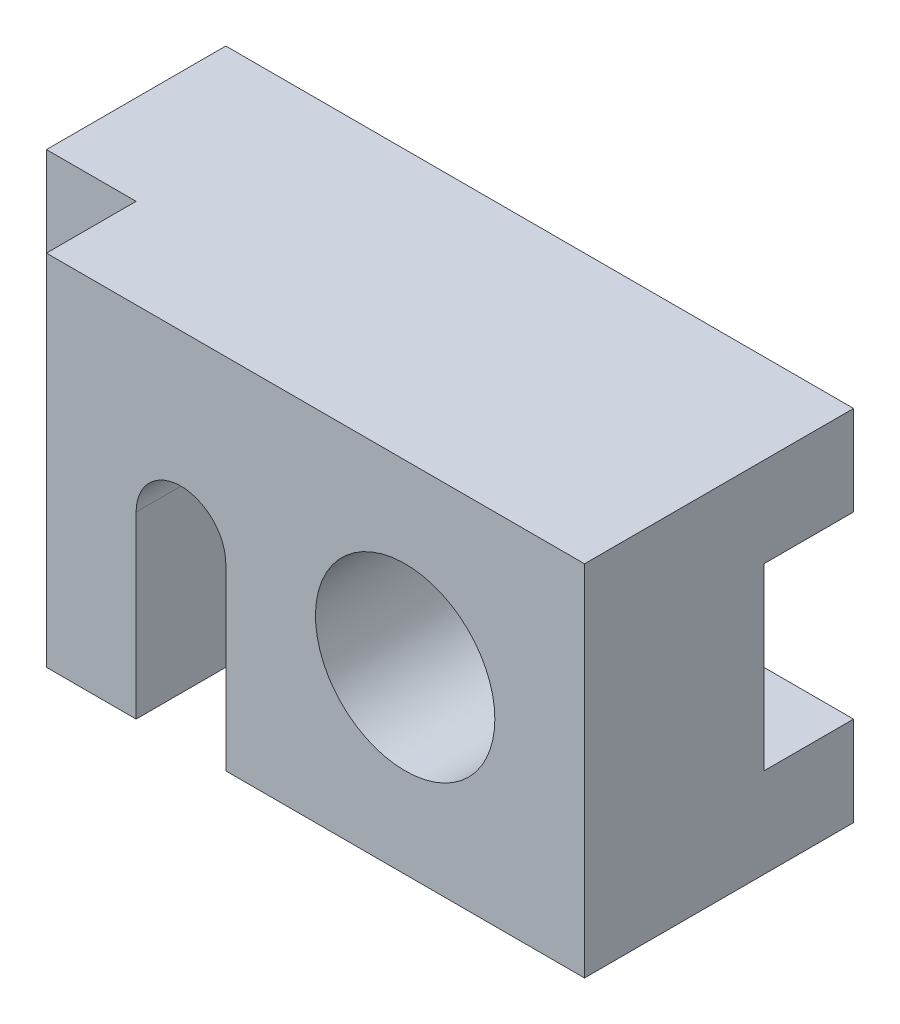
ISO-10303-21;
HEADER;
FILE_DESCRIPTION(('STEP AP214'),'2;1');
FILE_NAME('part.step','',(''),(''),'','','');
FILE_SCHEMA(('AUTOMOTIVE_DESIGN { 1 0 10303 214 1 1 1 1 }'));
ENDSEC;
DATA;
#1=APPLICATION_CONTEXT('core data for automotive mechanical design processes');
#2=APPLICATION_PROTOCOL_DEFINITION('international standard','automotive_design',2000,#1);
#3=PRODUCT_CONTEXT('',#1,'mechanical');
#4=PRODUCT('Part','Part','',(#3));
#5=PRODUCT_RELATED_PRODUCT_CATEGORY('part','',(#4));
#6=PRODUCT_DEFINITION_FORMATION('','',#4);
#7=PRODUCT_DEFINITION_CONTEXT('part definition',#1,'design');
#8=PRODUCT_DEFINITION('design','',#6,#7);
#9=PRODUCT_DEFINITION_SHAPE('','',#8);
#10=(LENGTH_UNIT() NAMED_UNIT(*) SI_UNIT(.MILLI.,.METRE.));
#11=(NAMED_UNIT(*) PLANE_ANGLE_UNIT() SI_UNIT($,.RADIAN.));
#12=(NAMED_UNIT(*) SI_UNIT($,.STERADIAN.) SOLID_ANGLE_UNIT());
#13=UNCERTAINTY_MEASURE_WITH_UNIT(LENGTH_MEASURE(1.E-05),#10,'distance_accuracy_value','');
#14=(GEOMETRIC_REPRESENTATION_CONTEXT(3) GLOBAL_UNCERTAINTY_ASSIGNED_CONTEXT((#13)) GLOBAL_UNIT_ASSIGNED_CONTEXT((#10,
#11,#12)) REPRESENTATION_CONTEXT('',''));
#15=CARTESIAN_POINT('',(0.,0.,0.));
#16=DIRECTION('',(0.,0.,1.));
#17=DIRECTION('',(1.,0.,0.));
#18=AXIS2_PLACEMENT_3D('',#15,#16,#17);
#19=CARTESIAN_POINT('',(0.,12.,36.));
#20=DIRECTION('',(0.,1.,0.));
#21=DIRECTION('',(0.,0.,1.));
#22=AXIS2_PLACEMENT_3D('',#19,#20,#21);
#23=PLANE('',#22);
#24=DIRECTION('',(-1.,0.,0.));
#25=VECTOR('',#24,1.);
#26=CARTESIAN_POINT('',(84.,12.,12.));
#27=LINE('',#26,#25);
#28=CARTESIAN_POINT('',(24.,12.,12.));
#29=VERTEX_POINT('',#28);
#30=CARTESIAN_POINT('',(0.,12.,12.));
#31=VERTEX_POINT('',#30);
#32=EDGE_CURVE('E189',#29,#31,#27,.T.);
#33=ORIENTED_EDGE('',*,*,#32,.F.);
#34=DIRECTION('',(-1.,0.,0.));
#35=VECTOR('',#34,1.);
#36=CARTESIAN_POINT('',(24.,12.,12.));
#37=LINE('',#36,#35);
#38=CARTESIAN_POINT('',(36.,12.,12.));
#39=VERTEX_POINT('',#38);
#40=EDGE_CURVE('E160',#39,#29,#37,.T.);
#41=ORIENTED_EDGE('',*,*,#40,.F.);
#42=CARTESIAN_POINT('',(60.,12.,12.));
#43=VERTEX_POINT('',#42);
#44=EDGE_CURVE('E202',#43,#39,#27,.T.);
#45=ORIENTED_EDGE('',*,*,#44,.F.);
#46=CARTESIAN_POINT('',(84.,12.,12.));
#47=VERTEX_POINT('',#46);
#48=EDGE_CURVE('E199',#47,#43,#27,.T.);
#49=ORIENTED_EDGE('',*,*,#48,.F.);
#50=DIRECTION('',(0.,0.,1.));
#51=VECTOR('',#50,1.);
#52=CARTESIAN_POINT('',(84.,12.,0.));
#53=LINE('',#52,#51);
#54=CARTESIAN_POINT('',(84.,12.,0.));
#55=VERTEX_POINT('',#54);
#56=EDGE_CURVE('E179',#55,#47,#53,.T.);
#57=ORIENTED_EDGE('',*,*,#56,.F.);
#58=DIRECTION('',(1.,0.,0.));
#59=VECTOR('',#58,1.);
#60=CARTESIAN_POINT('',(0.,12.,0.));
#61=LINE('',#60,#59);
#62=CARTESIAN_POINT('',(0.,12.,0.));
#63=VERTEX_POINT('',#62);
#64=EDGE_CURVE('E257',#63,#55,#61,.T.);
#65=ORIENTED_EDGE('',*,*,#64,.F.);
#66=DIRECTION('',(0.,0.,1.));
#67=VECTOR('',#66,1.);
#68=CARTESIAN_POINT('',(0.,12.,0.));
#69=LINE('',#68,#67);
#70=EDGE_CURVE('E177',#63,#31,#69,.T.);
#71=ORIENTED_EDGE('',*,*,#70,.T.);
#72=EDGE_LOOP('',(#33,#41,#45,#49,#57,#65,#71));
#73=FACE_BOUND('',#72,.T.);
#74=ADVANCED_FACE('F35',(#73),#23,.T.);
#75=CARTESIAN_POINT('',(0.,0.,0.));
#76=DIRECTION('',(0.,0.,1.));
#77=DIRECTION('',(1.,0.,0.));
#78=AXIS2_PLACEMENT_3D('',#75,#76,#77);
#79=PLANE('',#78);
#80=DIRECTION('',(0.,1.,0.));
#81=VECTOR('',#80,1.);
#82=CARTESIAN_POINT('',(84.,0.,0.));
#83=LINE('',#82,#81);
#84=CARTESIAN_POINT('',(84.,36.,0.));
#85=VERTEX_POINT('',#84);
#86=CARTESIAN_POINT('',(84.,48.,0.));
#87=VERTEX_POINT('',#86);
#88=EDGE_CURVE('E250',#85,#87,#83,.T.);
#89=ORIENTED_EDGE('',*,*,#88,.F.);
#90=DIRECTION('',(-1.,0.,0.));
#91=VECTOR('',#90,1.);
#92=CARTESIAN_POINT('',(0.,36.,0.));
#93=LINE('',#92,#91);
#94=CARTESIAN_POINT('',(0.,36.,0.));
#95=VERTEX_POINT('',#94);
#96=EDGE_CURVE('E43',#85,#95,#93,.T.);
#97=ORIENTED_EDGE('',*,*,#96,.T.);
#98=DIRECTION('',(0.,1.,0.));
#99=VECTOR('',#98,1.);
#100=CARTESIAN_POINT('',(0.,0.,0.));
#101=LINE('',#100,#99);
#102=CARTESIAN_POINT('',(0.,48.,0.));
#103=VERTEX_POINT('',#102);
#104=EDGE_CURVE('E225',#95,#103,#101,.T.);
#105=ORIENTED_EDGE('',*,*,#104,.T.);
#106=DIRECTION('',(1.,0.,0.));
#107=VECTOR('',#106,1.);
#108=CARTESIAN_POINT('',(0.,48.,0.));
#109=LINE('',#108,#107);
#110=EDGE_CURVE('E254',#103,#87,#109,.T.);
#111=ORIENTED_EDGE('',*,*,#110,.T.);
#112=EDGE_LOOP('',(#89,#97,#105,#111));
#113=FACE_BOUND('',#112,.T.);
#114=ADVANCED_FACE('F278',(#113),#79,.F.);
#115=CARTESIAN_POINT('',(24.,0.,36.));
#116=DIRECTION('',(1.,0.,0.));
#117=DIRECTION('',(0.,0.,-1.));
#118=AXIS2_PLACEMENT_3D('',#115,#116,#117);
#119=PLANE('',#118);
#120=DIRECTION('',(0.,-1.,0.));
#121=VECTOR('',#120,1.);
#122=CARTESIAN_POINT('',(24.,0.,12.));
#123=LINE('',#122,#121);
#124=CARTESIAN_POINT('',(24.,24.,12.));
#125=VERTEX_POINT('',#124);
#126=EDGE_CURVE('E205',#125,#29,#123,.T.);
#127=ORIENTED_EDGE('',*,*,#126,.F.);
#128=DIRECTION('',(0.,0.,-1.));
#129=VECTOR('',#128,1.);
#130=CARTESIAN_POINT('',(24.,24.,36.));
#131=LINE('',#130,#129);
#132=CARTESIAN_POINT('',(24.,24.,36.));
#133=VERTEX_POINT('',#132);
#134=EDGE_CURVE('E262',#133,#125,#131,.T.);
#135=ORIENTED_EDGE('',*,*,#134,.F.);
#136=DIRECTION('',(0.,-1.,0.));
#137=VECTOR('',#136,1.);
#138=CARTESIAN_POINT('',(24.,0.,36.));
#139=LINE('',#138,#137);
#140=CARTESIAN_POINT('',(24.,0.,36.));
#141=VERTEX_POINT('',#140);
#142=EDGE_CURVE('E154',#133,#141,#139,.T.);
#143=ORIENTED_EDGE('',*,*,#142,.T.);
#144=DIRECTION('',(0.,0.,1.));
#145=VECTOR('',#144,1.);
#146=CARTESIAN_POINT('',(24.,0.,12.));
#147=LINE('',#146,#145);
#148=CARTESIAN_POINT('',(24.,0.,12.));
#149=VERTEX_POINT('',#148);
#150=EDGE_CURVE('E147',#149,#141,#147,.T.);
#151=ORIENTED_EDGE('',*,*,#150,.F.);
#152=DIRECTION('',(0.,-1.,0.));
#153=VECTOR('',#152,1.);
#154=CARTESIAN_POINT('',(24.,12.,12.));
#155=LINE('',#154,#153);
#156=EDGE_CURVE('E151',#29,#149,#155,.T.);
#157=ORIENTED_EDGE('',*,*,#156,.F.);
#158=EDGE_LOOP('',(#127,#135,#143,#151,#157));
#159=FACE_BOUND('',#158,.T.);
#160=ADVANCED_FACE('F150',(#159),#119,.T.);
#161=CARTESIAN_POINT('',(30.,24.0000002016372,36.));
#162=DIRECTION('',(0.,0.,-1.));
#163=DIRECTION('',(-1.,0.,0.));
#164=AXIS2_PLACEMENT_3D('',#161,#162,#163);
#165=CYLINDRICAL_SURFACE('',#164,6.);
#166=ORIENTED_EDGE('',*,*,#134,.T.);
#167=CARTESIAN_POINT('',(30.,24.0000002016372,12.));
#168=DIRECTION('',(0.,0.,1.));
#169=DIRECTION('',(0.,-1.,0.));
#170=AXIS2_PLACEMENT_3D('',#167,#168,#169);
#171=CIRCLE('',#170,6.);
#172=CARTESIAN_POINT('',(36.,24.,12.));
#173=VERTEX_POINT('',#172);
#174=EDGE_CURVE('E197',#125,#173,#171,.F.);
#175=ORIENTED_EDGE('',*,*,#174,.T.);
#176=DIRECTION('',(0.,0.,-1.));
#177=VECTOR('',#176,1.);
#178=CARTESIAN_POINT('',(36.,24.,36.));
#179=LINE('',#178,#177);
#180=CARTESIAN_POINT('',(36.,24.,36.));
#181=VERTEX_POINT('',#180);
#182=EDGE_CURVE('E259',#181,#173,#179,.T.);
#183=ORIENTED_EDGE('',*,*,#182,.F.);
#184=CARTESIAN_POINT('',(30.,24.0000002016372,36.));
#185=DIRECTION('',(0.,0.,1.));
#186=DIRECTION('',(1.,0.,0.));
#187=AXIS2_PLACEMENT_3D('',#184,#185,#186);
#188=CIRCLE('',#187,6.);
#189=EDGE_CURVE('E241',#133,#181,#188,.F.);
#190=ORIENTED_EDGE('',*,*,#189,.F.);
#191=EDGE_LOOP('',(#166,#175,#183,#190));
#192=FACE_BOUND('',#191,.T.);
#193=ADVANCED_FACE('F333',(#192),#165,.F.);
#194=CARTESIAN_POINT('',(0.,0.,36.));
#195=DIRECTION('',(-1.,0.,0.));
#196=DIRECTION('',(0.,0.,1.));
#197=AXIS2_PLACEMENT_3D('',#194,#195,#196);
#198=PLANE('',#197);
#199=DIRECTION('',(0.,0.,-1.));
#200=VECTOR('',#199,1.);
#201=CARTESIAN_POINT('',(0.,36.,0.));
#202=LINE('',#201,#200);
#203=CARTESIAN_POINT('',(0.,36.,12.));
#204=VERTEX_POINT('',#203);
#205=EDGE_CURVE('E183',#204,#95,#202,.T.);
#206=ORIENTED_EDGE('',*,*,#205,.F.);
#207=DIRECTION('',(0.,1.,0.));
#208=VECTOR('',#207,1.);
#209=CARTESIAN_POINT('',(0.,36.,12.));
#210=LINE('',#209,#208);
#211=EDGE_CURVE('E192',#31,#204,#210,.T.);
#212=ORIENTED_EDGE('',*,*,#211,.F.);
#213=ORIENTED_EDGE('',*,*,#70,.F.);
#214=CARTESIAN_POINT('',(0.,0.,0.));
#215=VERTEX_POINT('',#214);
#216=EDGE_CURVE('E245',#215,#63,#101,.T.);
#217=ORIENTED_EDGE('',*,*,#216,.F.);
#218=DIRECTION('',(0.,0.,-1.));
#219=VECTOR('',#218,1.);
#220=CARTESIAN_POINT('',(0.,0.,36.));
#221=LINE('',#220,#219);
#222=CARTESIAN_POINT('',(0.,0.,24.));
#223=VERTEX_POINT('',#222);
#224=EDGE_CURVE('E263',#223,#215,#221,.T.);
#225=ORIENTED_EDGE('',*,*,#224,.F.);
#226=DIRECTION('',(0.,1.,0.));
#227=VECTOR('',#226,1.);
#228=CARTESIAN_POINT('',(0.,0.,24.));
#229=LINE('',#228,#227);
#230=CARTESIAN_POINT('',(0.,48.,24.));
#231=VERTEX_POINT('',#230);
#232=EDGE_CURVE('E222',#223,#231,#229,.T.);
#233=ORIENTED_EDGE('',*,*,#232,.T.);
#234=DIRECTION('',(0.,0.,-1.));
#235=VECTOR('',#234,1.);
#236=CARTESIAN_POINT('',(0.,48.,36.));
#237=LINE('',#236,#235);
#238=EDGE_CURVE('E244',#231,#103,#237,.T.);
#239=ORIENTED_EDGE('',*,*,#238,.T.);
#240=ORIENTED_EDGE('',*,*,#104,.F.);
#241=EDGE_LOOP('',(#206,#212,#213,#217,#225,#233,#239,#240));
#242=FACE_BOUND('',#241,.T.);
#243=ADVANCED_FACE('F37',(#242),#198,.T.);
#244=CARTESIAN_POINT('',(0.,0.,36.));
#245=DIRECTION('',(0.,1.,0.));
#246=DIRECTION('',(0.,0.,1.));
#247=AXIS2_PLACEMENT_3D('',#244,#245,#246);
#248=PLANE('',#247);
#249=DIRECTION('',(1.,0.,0.));
#250=VECTOR('',#249,1.);
#251=CARTESIAN_POINT('',(24.,0.,12.));
#252=LINE('',#251,#250);
#253=CARTESIAN_POINT('',(36.,0.,12.));
#254=VERTEX_POINT('',#253);
#255=EDGE_CURVE('E165',#149,#254,#252,.T.);
#256=ORIENTED_EDGE('',*,*,#255,.F.);
#257=ORIENTED_EDGE('',*,*,#150,.T.);
#258=DIRECTION('',(1.,0.,0.));
#259=VECTOR('',#258,1.);
#260=CARTESIAN_POINT('',(0.,0.,36.));
#261=LINE('',#260,#259);
#262=CARTESIAN_POINT('',(12.,0.,36.));
#263=VERTEX_POINT('',#262);
#264=EDGE_CURVE('E229',#263,#141,#261,.T.);
#265=ORIENTED_EDGE('',*,*,#264,.F.);
#266=DIRECTION('',(0.,0.,-1.));
#267=VECTOR('',#266,1.);
#268=CARTESIAN_POINT('',(12.,0.,36.));
#269=LINE('',#268,#267);
#270=CARTESIAN_POINT('',(12.,0.,24.));
#271=VERTEX_POINT('',#270);
#272=EDGE_CURVE('E210',#263,#271,#269,.T.);
#273=ORIENTED_EDGE('',*,*,#272,.T.);
#274=DIRECTION('',(-1.,0.,0.));
#275=VECTOR('',#274,1.);
#276=CARTESIAN_POINT('',(0.,0.,24.));
#277=LINE('',#276,#275);
#278=EDGE_CURVE('E213',#271,#223,#277,.T.);
#279=ORIENTED_EDGE('',*,*,#278,.T.);
#280=ORIENTED_EDGE('',*,*,#224,.T.);
#281=DIRECTION('',(1.,0.,0.));
#282=VECTOR('',#281,1.);
#283=CARTESIAN_POINT('',(0.,0.,0.));
#284=LINE('',#283,#282);
#285=CARTESIAN_POINT('',(84.,0.,0.));
#286=VERTEX_POINT('',#285);
#287=EDGE_CURVE('E248',#215,#286,#284,.T.);
#288=ORIENTED_EDGE('',*,*,#287,.T.);
#289=DIRECTION('',(0.,0.,-1.));
#290=VECTOR('',#289,1.);
#291=CARTESIAN_POINT('',(84.,0.,36.));
#292=LINE('',#291,#290);
#293=CARTESIAN_POINT('',(84.,0.,36.));
#294=VERTEX_POINT('',#293);
#295=EDGE_CURVE('E271',#294,#286,#292,.T.);
#296=ORIENTED_EDGE('',*,*,#295,.F.);
#297=CARTESIAN_POINT('',(36.,0.,36.));
#298=VERTEX_POINT('',#297);
#299=EDGE_CURVE('E232',#298,#294,#261,.T.);
#300=ORIENTED_EDGE('',*,*,#299,.F.);
#301=DIRECTION('',(0.,0.,1.));
#302=VECTOR('',#301,1.);
#303=CARTESIAN_POINT('',(36.,0.,12.));
#304=LINE('',#303,#302);
#305=EDGE_CURVE('E159',#254,#298,#304,.T.);
#306=ORIENTED_EDGE('',*,*,#305,.F.);
#307=EDGE_LOOP('',(#256,#257,#265,#273,#279,#280,#288,#296,#300,#306));
#308=FACE_BOUND('',#307,.T.);
#309=ADVANCED_FACE('F170',(#308),#248,.F.);
#310=CARTESIAN_POINT('',(84.,0.,36.));
#311=DIRECTION('',(-1.,0.,0.));
#312=DIRECTION('',(0.,-1.,0.));
#313=AXIS2_PLACEMENT_3D('',#310,#311,#312);
#314=PLANE('',#313);
#315=DIRECTION('',(0.,1.,0.));
#316=VECTOR('',#315,1.);
#317=CARTESIAN_POINT('',(84.,36.,12.));
#318=LINE('',#317,#316);
#319=CARTESIAN_POINT('',(84.,36.,12.));
#320=VERTEX_POINT('',#319);
#321=EDGE_CURVE('E182',#47,#320,#318,.T.);
#322=ORIENTED_EDGE('',*,*,#321,.T.);
#323=DIRECTION('',(0.,0.,-1.));
#324=VECTOR('',#323,1.);
#325=CARTESIAN_POINT('',(84.,36.,0.));
#326=LINE('',#325,#324);
#327=EDGE_CURVE('E186',#320,#85,#326,.T.);
#328=ORIENTED_EDGE('',*,*,#327,.T.);
#329=ORIENTED_EDGE('',*,*,#88,.T.);
#330=DIRECTION('',(0.,0.,-1.));
#331=VECTOR('',#330,1.);
#332=CARTESIAN_POINT('',(84.,48.,36.));
#333=LINE('',#332,#331);
#334=CARTESIAN_POINT('',(84.,48.,36.));
#335=VERTEX_POINT('',#334);
#336=EDGE_CURVE('E268',#335,#87,#333,.T.);
#337=ORIENTED_EDGE('',*,*,#336,.F.);
#338=DIRECTION('',(0.,1.,0.));
#339=VECTOR('',#338,1.);
#340=CARTESIAN_POINT('',(84.,0.,36.));
#341=LINE('',#340,#339);
#342=EDGE_CURVE('E231',#294,#335,#341,.T.);
#343=ORIENTED_EDGE('',*,*,#342,.F.);
#344=ORIENTED_EDGE('',*,*,#295,.T.);
#345=EDGE_CURVE('E251',#286,#55,#83,.T.);
#346=ORIENTED_EDGE('',*,*,#345,.T.);
#347=ORIENTED_EDGE('',*,*,#56,.T.);
#348=EDGE_LOOP('',(#322,#328,#329,#337,#343,#344,#346,#347));
#349=FACE_BOUND('',#348,.T.);
#350=ADVANCED_FACE('F293',(#349),#314,.F.);
#351=CARTESIAN_POINT('',(60.,24.,36.));
#352=DIRECTION('',(0.,0.,-1.));
#353=DIRECTION('',(-1.,0.,0.));
#354=AXIS2_PLACEMENT_3D('',#351,#352,#353);
#355=CYLINDRICAL_SURFACE('',#354,12.);
#356=CARTESIAN_POINT('',(60.,24.,12.));
#357=DIRECTION('',(0.,0.,1.));
#358=DIRECTION('',(0.,-1.,0.));
#359=AXIS2_PLACEMENT_3D('',#356,#357,#358);
#360=CIRCLE('',#359,12.);
#361=CARTESIAN_POINT('',(60.,36.,12.));
#362=VERTEX_POINT('',#361);
#363=EDGE_CURVE('E209',#43,#362,#360,.T.);
#364=ORIENTED_EDGE('',*,*,#363,.F.);
#365=EDGE_CURVE('E207',#362,#43,#360,.T.);
#366=ORIENTED_EDGE('',*,*,#365,.F.);
#367=EDGE_LOOP('',(#364,#366));
#368=FACE_BOUND('',#367,.T.);
#369=CARTESIAN_POINT('',(60.,24.,36.));
#370=DIRECTION('',(0.,0.,1.));
#371=DIRECTION('',(1.,0.,0.));
#372=AXIS2_PLACEMENT_3D('',#369,#370,#371);
#373=CIRCLE('',#372,12.);
#374=CARTESIAN_POINT('',(72.,24.,36.));
#375=VERTEX_POINT('',#374);
#376=EDGE_CURVE('E237',#375,#375,#373,.T.);
#377=ORIENTED_EDGE('',*,*,#376,.T.);
#378=EDGE_LOOP('',(#377));
#379=FACE_BOUND('',#378,.T.);
#380=ADVANCED_FACE('F321',(#368,#379),#355,.F.);
#381=CARTESIAN_POINT('',(0.,48.,36.));
#382=DIRECTION('',(0.,1.,0.));
#383=DIRECTION('',(0.,0.,1.));
#384=AXIS2_PLACEMENT_3D('',#381,#382,#383);
#385=PLANE('',#384);
#386=DIRECTION('',(-1.,0.,0.));
#387=VECTOR('',#386,1.);
#388=CARTESIAN_POINT('',(0.,48.,24.));
#389=LINE('',#388,#387);
#390=CARTESIAN_POINT('',(12.,48.,24.));
#391=VERTEX_POINT('',#390);
#392=EDGE_CURVE('E214',#391,#231,#389,.T.);
#393=ORIENTED_EDGE('',*,*,#392,.F.);
#394=DIRECTION('',(0.,0.,-1.));
#395=VECTOR('',#394,1.);
#396=CARTESIAN_POINT('',(12.,48.,36.));
#397=LINE('',#396,#395);
#398=CARTESIAN_POINT('',(12.,48.,36.));
#399=VERTEX_POINT('',#398);
#400=EDGE_CURVE('E218',#399,#391,#397,.T.);
#401=ORIENTED_EDGE('',*,*,#400,.F.);
#402=DIRECTION('',(1.,0.,0.));
#403=VECTOR('',#402,1.);
#404=CARTESIAN_POINT('',(0.,48.,36.));
#405=LINE('',#404,#403);
#406=EDGE_CURVE('E235',#399,#335,#405,.T.);
#407=ORIENTED_EDGE('',*,*,#406,.T.);
#408=ORIENTED_EDGE('',*,*,#336,.T.);
#409=ORIENTED_EDGE('',*,*,#110,.F.);
#410=ORIENTED_EDGE('',*,*,#238,.F.);
#411=EDGE_LOOP('',(#393,#401,#407,#408,#409,#410));
#412=FACE_BOUND('',#411,.T.);
#413=ADVANCED_FACE('F287',(#412),#385,.T.);
#414=CARTESIAN_POINT('',(36.,0.,36.));
#415=DIRECTION('',(1.,0.,0.));
#416=DIRECTION('',(0.,0.,-1.));
#417=AXIS2_PLACEMENT_3D('',#414,#415,#416);
#418=PLANE('',#417);
#419=ORIENTED_EDGE('',*,*,#182,.T.);
#420=DIRECTION('',(0.,-1.,0.));
#421=VECTOR('',#420,1.);
#422=CARTESIAN_POINT('',(36.,0.,12.));
#423=LINE('',#422,#421);
#424=EDGE_CURVE('E11',#173,#39,#423,.T.);
#425=ORIENTED_EDGE('',*,*,#424,.T.);
#426=DIRECTION('',(0.,1.,0.));
#427=VECTOR('',#426,1.);
#428=CARTESIAN_POINT('',(36.,12.,12.));
#429=LINE('',#428,#427);
#430=EDGE_CURVE('E172',#254,#39,#429,.T.);
#431=ORIENTED_EDGE('',*,*,#430,.F.);
#432=ORIENTED_EDGE('',*,*,#305,.T.);
#433=DIRECTION('',(0.,-1.,0.));
#434=VECTOR('',#433,1.);
#435=CARTESIAN_POINT('',(36.,0.,36.));
#436=LINE('',#435,#434);
#437=EDGE_CURVE('E50',#181,#298,#436,.T.);
#438=ORIENTED_EDGE('',*,*,#437,.F.);
#439=EDGE_LOOP('',(#419,#425,#431,#432,#438));
#440=FACE_BOUND('',#439,.T.);
#441=ADVANCED_FACE('F327',(#440),#418,.F.);
#442=CARTESIAN_POINT('',(0.,0.,36.));
#443=DIRECTION('',(0.,0.,1.));
#444=DIRECTION('',(1.,0.,0.));
#445=AXIS2_PLACEMENT_3D('',#442,#443,#444);
#446=PLANE('',#445);
#447=ORIENTED_EDGE('',*,*,#264,.T.);
#448=ORIENTED_EDGE('',*,*,#142,.F.);
#449=ORIENTED_EDGE('',*,*,#189,.T.);
#450=ORIENTED_EDGE('',*,*,#437,.T.);
#451=ORIENTED_EDGE('',*,*,#299,.T.);
#452=ORIENTED_EDGE('',*,*,#342,.T.);
#453=ORIENTED_EDGE('',*,*,#406,.F.);
#454=DIRECTION('',(0.,1.,0.));
#455=VECTOR('',#454,1.);
#456=CARTESIAN_POINT('',(12.,0.,36.));
#457=LINE('',#456,#455);
#458=EDGE_CURVE('E217',#263,#399,#457,.T.);
#459=ORIENTED_EDGE('',*,*,#458,.F.);
#460=EDGE_LOOP('',(#447,#448,#449,#450,#451,#452,#453,#459));
#461=FACE_BOUND('',#460,.T.);
#462=ORIENTED_EDGE('',*,*,#376,.F.);
#463=EDGE_LOOP('',(#462));
#464=FACE_BOUND('',#463,.T.);
#465=ADVANCED_FACE('F343',(#461,#464),#446,.T.);
#466=ORIENTED_EDGE('',*,*,#216,.T.);
#467=ORIENTED_EDGE('',*,*,#64,.T.);
#468=ORIENTED_EDGE('',*,*,#345,.F.);
#469=ORIENTED_EDGE('',*,*,#287,.F.);
#470=EDGE_LOOP('',(#466,#467,#468,#469));
#471=FACE_BOUND('',#470,.T.);
#472=ADVANCED_FACE('F316',(#471),#79,.F.);
#473=CARTESIAN_POINT('',(0.,0.,24.));
#474=DIRECTION('',(0.,0.,-1.));
#475=DIRECTION('',(-1.,0.,0.));
#476=AXIS2_PLACEMENT_3D('',#473,#474,#475);
#477=PLANE('',#476);
#478=ORIENTED_EDGE('',*,*,#392,.T.);
#479=ORIENTED_EDGE('',*,*,#232,.F.);
#480=ORIENTED_EDGE('',*,*,#278,.F.);
#481=DIRECTION('',(0.,1.,0.));
#482=VECTOR('',#481,1.);
#483=CARTESIAN_POINT('',(12.,0.,24.));
#484=LINE('',#483,#482);
#485=EDGE_CURVE('E226',#271,#391,#484,.T.);
#486=ORIENTED_EDGE('',*,*,#485,.T.);
#487=EDGE_LOOP('',(#478,#479,#480,#486));
#488=FACE_BOUND('',#487,.T.);
#489=ADVANCED_FACE('F347',(#488),#477,.F.);
#490=CARTESIAN_POINT('',(12.,0.,36.));
#491=DIRECTION('',(1.,0.,0.));
#492=DIRECTION('',(0.,0.,-1.));
#493=AXIS2_PLACEMENT_3D('',#490,#491,#492);
#494=PLANE('',#493);
#495=ORIENTED_EDGE('',*,*,#400,.T.);
#496=ORIENTED_EDGE('',*,*,#485,.F.);
#497=ORIENTED_EDGE('',*,*,#272,.F.);
#498=ORIENTED_EDGE('',*,*,#458,.T.);
#499=EDGE_LOOP('',(#495,#496,#497,#498));
#500=FACE_BOUND('',#499,.T.);
#501=ADVANCED_FACE('F306',(#500),#494,.F.);
#502=CARTESIAN_POINT('',(84.,36.,12.));
#503=DIRECTION('',(0.,0.,1.));
#504=DIRECTION('',(0.,-1.,0.));
#505=AXIS2_PLACEMENT_3D('',#502,#503,#504);
#506=PLANE('',#505);
#507=ORIENTED_EDGE('',*,*,#363,.T.);
#508=DIRECTION('',(-1.,0.,0.));
#509=VECTOR('',#508,1.);
#510=CARTESIAN_POINT('',(84.,36.,12.));
#511=LINE('',#510,#509);
#512=EDGE_CURVE('E58',#320,#362,#511,.T.);
#513=ORIENTED_EDGE('',*,*,#512,.F.);
#514=ORIENTED_EDGE('',*,*,#321,.F.);
#515=ORIENTED_EDGE('',*,*,#48,.T.);
#516=EDGE_LOOP('',(#507,#513,#514,#515));
#517=FACE_BOUND('',#516,.T.);
#518=ADVANCED_FACE('F298',(#517),#506,.F.);
#519=CARTESIAN_POINT('',(84.,36.,0.));
#520=DIRECTION('',(0.,1.,0.));
#521=DIRECTION('',(0.,0.,1.));
#522=AXIS2_PLACEMENT_3D('',#519,#520,#521);
#523=PLANE('',#522);
#524=EDGE_CURVE('E198',#362,#204,#511,.T.);
#525=ORIENTED_EDGE('',*,*,#524,.T.);
#526=ORIENTED_EDGE('',*,*,#205,.T.);
#527=ORIENTED_EDGE('',*,*,#96,.F.);
#528=ORIENTED_EDGE('',*,*,#327,.F.);
#529=ORIENTED_EDGE('',*,*,#512,.T.);
#530=EDGE_LOOP('',(#525,#526,#527,#528,#529));
#531=FACE_BOUND('',#530,.T.);
#532=ADVANCED_FACE('F295',(#531),#523,.F.);
#533=ORIENTED_EDGE('',*,*,#365,.T.);
#534=ORIENTED_EDGE('',*,*,#44,.T.);
#535=ORIENTED_EDGE('',*,*,#424,.F.);
#536=ORIENTED_EDGE('',*,*,#174,.F.);
#537=ORIENTED_EDGE('',*,*,#126,.T.);
#538=ORIENTED_EDGE('',*,*,#32,.T.);
#539=ORIENTED_EDGE('',*,*,#211,.T.);
#540=ORIENTED_EDGE('',*,*,#524,.F.);
#541=EDGE_LOOP('',(#533,#534,#535,#536,#537,#538,#539,#540));
#542=FACE_BOUND('',#541,.T.);
#543=ADVANCED_FACE('F297',(#542),#506,.F.);
#544=CARTESIAN_POINT('',(0.,0.,12.));
#545=DIRECTION('',(0.,0.,1.));
#546=DIRECTION('',(1.,0.,0.));
#547=AXIS2_PLACEMENT_3D('',#544,#545,#546);
#548=PLANE('',#547);
#549=ORIENTED_EDGE('',*,*,#156,.T.);
#550=ORIENTED_EDGE('',*,*,#255,.T.);
#551=ORIENTED_EDGE('',*,*,#430,.T.);
#552=ORIENTED_EDGE('',*,*,#40,.T.);
#553=EDGE_LOOP('',(#549,#550,#551,#552));
#554=FACE_BOUND('',#553,.T.);
#555=ADVANCED_FACE('F164',(#554),#548,.T.);
#556=CLOSED_SHELL('',(#74,#114,#160,#193,#243,#309,#350,#380,#413,#441,#465,#472,#489,#501,#518,
#532,#543,#555));
#557=MANIFOLD_SOLID_BREP('B2',#556);
#558=ADVANCED_BREP_SHAPE_REPRESENTATION('',(#18,#557),#14);
#559=SHAPE_DEFINITION_REPRESENTATION(#9,#558);
ENDSEC;
END-ISO-10303-21;
